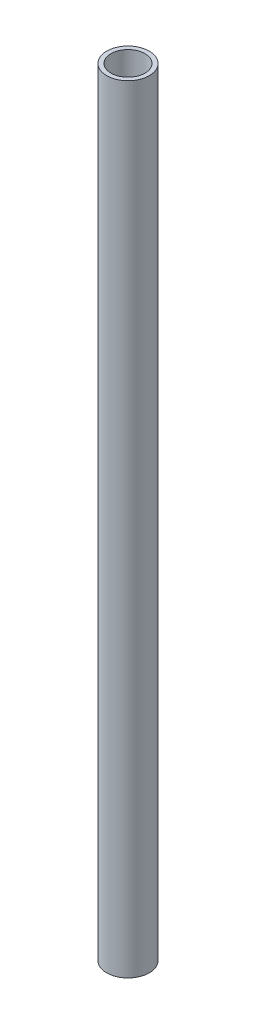
ISO-10303-21;
HEADER;
FILE_DESCRIPTION(('STEP AP214'),'2;1');
FILE_NAME('part.step','',(''),(''),'','','');
FILE_SCHEMA(('AUTOMOTIVE_DESIGN { 1 0 10303 214 1 1 1 1 }'));
ENDSEC;
DATA;
#1=APPLICATION_CONTEXT('core data for automotive mechanical design processes');
#2=APPLICATION_PROTOCOL_DEFINITION('international standard','automotive_design',2000,#1);
#3=PRODUCT_CONTEXT('',#1,'mechanical');
#4=PRODUCT('Part','Part','',(#3));
#5=PRODUCT_RELATED_PRODUCT_CATEGORY('part','',(#4));
#6=PRODUCT_DEFINITION_FORMATION('','',#4);
#7=PRODUCT_DEFINITION_CONTEXT('part definition',#1,'design');
#8=PRODUCT_DEFINITION('design','',#6,#7);
#9=PRODUCT_DEFINITION_SHAPE('','',#8);
#10=(LENGTH_UNIT() NAMED_UNIT(*) SI_UNIT(.MILLI.,.METRE.));
#11=(NAMED_UNIT(*) PLANE_ANGLE_UNIT() SI_UNIT($,.RADIAN.));
#12=(NAMED_UNIT(*) SI_UNIT($,.STERADIAN.) SOLID_ANGLE_UNIT());
#13=UNCERTAINTY_MEASURE_WITH_UNIT(LENGTH_MEASURE(1.E-05),#10,'distance_accuracy_value','');
#14=(GEOMETRIC_REPRESENTATION_CONTEXT(3) GLOBAL_UNCERTAINTY_ASSIGNED_CONTEXT((#13)) GLOBAL_UNIT_ASSIGNED_CONTEXT((#10,
#11,#12)) REPRESENTATION_CONTEXT('',''));
#15=CARTESIAN_POINT('',(0.,0.,0.));
#16=DIRECTION('',(0.,0.,1.));
#17=DIRECTION('',(1.,0.,0.));
#18=AXIS2_PLACEMENT_3D('',#15,#16,#17);
#19=CARTESIAN_POINT('',(0.,609.6,0.));
#20=DIRECTION('',(0.,1.,0.));
#21=DIRECTION('',(0.,0.,1.));
#22=AXIS2_PLACEMENT_3D('',#19,#20,#21);
#23=PLANE('',#22);
#24=CARTESIAN_POINT('',(0.,609.6,0.));
#25=DIRECTION('',(0.,1.,0.));
#26=DIRECTION('',(0.,0.,1.));
#27=AXIS2_PLACEMENT_3D('',#24,#25,#26);
#28=CIRCLE('',#27,16.7005);
#29=CARTESIAN_POINT('',(0.,609.6,16.7005));
#30=VERTEX_POINT('',#29);
#31=EDGE_CURVE('E10',#30,#30,#28,.T.);
#32=ORIENTED_EDGE('',*,*,#31,.T.);
#33=EDGE_LOOP('',(#32));
#34=FACE_BOUND('',#33,.T.);
#35=CARTESIAN_POINT('',(0.,609.6,0.));
#36=DIRECTION('',(0.,1.,0.));
#37=DIRECTION('',(0.,0.,1.));
#38=AXIS2_PLACEMENT_3D('',#35,#36,#37);
#39=CIRCLE('',#38,13.3223);
#40=CARTESIAN_POINT('',(0.,609.6,13.3223));
#41=VERTEX_POINT('',#40);
#42=EDGE_CURVE('E43',#41,#41,#39,.T.);
#43=ORIENTED_EDGE('',*,*,#42,.F.);
#44=EDGE_LOOP('',(#43));
#45=FACE_BOUND('',#44,.T.);
#46=ADVANCED_FACE('F32',(#34,#45),#23,.T.);
#47=CARTESIAN_POINT('',(0.,0.,0.));
#48=DIRECTION('',(0.,1.,0.));
#49=DIRECTION('',(0.,0.,1.));
#50=AXIS2_PLACEMENT_3D('',#47,#48,#49);
#51=PLANE('',#50);
#52=CARTESIAN_POINT('',(0.,0.,0.));
#53=DIRECTION('',(0.,1.,0.));
#54=DIRECTION('',(0.,0.,1.));
#55=AXIS2_PLACEMENT_3D('',#52,#53,#54);
#56=CIRCLE('',#55,16.7005);
#57=CARTESIAN_POINT('',(0.,0.,16.7005));
#58=VERTEX_POINT('',#57);
#59=EDGE_CURVE('E36',#58,#58,#56,.T.);
#60=ORIENTED_EDGE('',*,*,#59,.F.);
#61=EDGE_LOOP('',(#60));
#62=FACE_BOUND('',#61,.T.);
#63=CARTESIAN_POINT('',(0.,0.,0.));
#64=DIRECTION('',(0.,1.,0.));
#65=DIRECTION('',(0.,0.,1.));
#66=AXIS2_PLACEMENT_3D('',#63,#64,#65);
#67=CIRCLE('',#66,13.3223);
#68=CARTESIAN_POINT('',(0.,0.,13.3223));
#69=VERTEX_POINT('',#68);
#70=EDGE_CURVE('E45',#69,#69,#67,.T.);
#71=ORIENTED_EDGE('',*,*,#70,.T.);
#72=EDGE_LOOP('',(#71));
#73=FACE_BOUND('',#72,.T.);
#74=ADVANCED_FACE('F55',(#62,#73),#51,.F.);
#75=CARTESIAN_POINT('',(0.,609.6,0.));
#76=DIRECTION('',(0.,-1.,0.));
#77=DIRECTION('',(0.,0.,-1.));
#78=AXIS2_PLACEMENT_3D('',#75,#76,#77);
#79=CYLINDRICAL_SURFACE('',#78,16.7005);
#80=ORIENTED_EDGE('',*,*,#31,.F.);
#81=EDGE_LOOP('',(#80));
#82=FACE_BOUND('',#81,.T.);
#83=ORIENTED_EDGE('',*,*,#59,.T.);
#84=EDGE_LOOP('',(#83));
#85=FACE_BOUND('',#84,.T.);
#86=ADVANCED_FACE('F34',(#82,#85),#79,.T.);
#87=CARTESIAN_POINT('',(0.,609.6,0.));
#88=DIRECTION('',(0.,-1.,0.));
#89=DIRECTION('',(0.,0.,-1.));
#90=AXIS2_PLACEMENT_3D('',#87,#88,#89);
#91=CYLINDRICAL_SURFACE('',#90,13.3223);
#92=ORIENTED_EDGE('',*,*,#42,.T.);
#93=EDGE_LOOP('',(#92));
#94=FACE_BOUND('',#93,.T.);
#95=ORIENTED_EDGE('',*,*,#70,.F.);
#96=EDGE_LOOP('',(#95));
#97=FACE_BOUND('',#96,.T.);
#98=ADVANCED_FACE('F51',(#94,#97),#91,.F.);
#99=CLOSED_SHELL('',(#46,#74,#86,#98));
#100=MANIFOLD_SOLID_BREP('B2',#99);
#101=ADVANCED_BREP_SHAPE_REPRESENTATION('',(#18,#100),#14);
#102=SHAPE_DEFINITION_REPRESENTATION(#9,#101);
ENDSEC;
END-ISO-10303-21;
